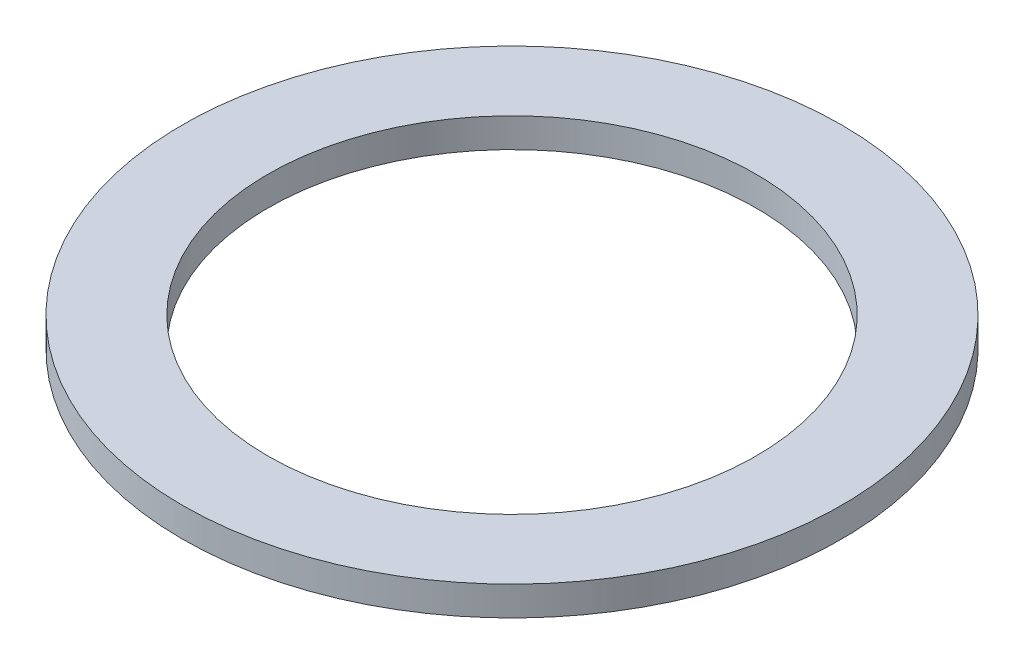
ISO-10303-21;
HEADER;
FILE_DESCRIPTION(('STEP AP214'),'2;1');
FILE_NAME('part.step','',(''),(''),'','','');
FILE_SCHEMA(('AUTOMOTIVE_DESIGN { 1 0 10303 214 1 1 1 1 }'));
ENDSEC;
DATA;
#1=APPLICATION_CONTEXT('core data for automotive mechanical design processes');
#2=APPLICATION_PROTOCOL_DEFINITION('international standard','automotive_design',2000,#1);
#3=PRODUCT_CONTEXT('',#1,'mechanical');
#4=PRODUCT('Part','Part','',(#3));
#5=PRODUCT_RELATED_PRODUCT_CATEGORY('part','',(#4));
#6=PRODUCT_DEFINITION_FORMATION('','',#4);
#7=PRODUCT_DEFINITION_CONTEXT('part definition',#1,'design');
#8=PRODUCT_DEFINITION('design','',#6,#7);
#9=PRODUCT_DEFINITION_SHAPE('','',#8);
#10=(LENGTH_UNIT() NAMED_UNIT(*) SI_UNIT(.MILLI.,.METRE.));
#11=(NAMED_UNIT(*) PLANE_ANGLE_UNIT() SI_UNIT($,.RADIAN.));
#12=(NAMED_UNIT(*) SI_UNIT($,.STERADIAN.) SOLID_ANGLE_UNIT());
#13=UNCERTAINTY_MEASURE_WITH_UNIT(LENGTH_MEASURE(1.E-05),#10,'distance_accuracy_value','');
#14=(GEOMETRIC_REPRESENTATION_CONTEXT(3) GLOBAL_UNCERTAINTY_ASSIGNED_CONTEXT((#13)) GLOBAL_UNIT_ASSIGNED_CONTEXT((#10,
#11,#12)) REPRESENTATION_CONTEXT('',''));
#15=CARTESIAN_POINT('',(0.,0.,0.));
#16=DIRECTION('',(0.,0.,1.));
#17=DIRECTION('',(1.,0.,0.));
#18=AXIS2_PLACEMENT_3D('',#15,#16,#17);
#19=CARTESIAN_POINT('',(0.,6.,0.));
#20=DIRECTION('',(0.,-1.,0.));
#21=DIRECTION('',(0.,0.,-1.));
#22=AXIS2_PLACEMENT_3D('',#19,#20,#21);
#23=CYLINDRICAL_SURFACE('',#22,67.5);
#24=CARTESIAN_POINT('',(0.,6.,0.));
#25=DIRECTION('',(0.,1.,0.));
#26=DIRECTION('',(0.,0.,1.));
#27=AXIS2_PLACEMENT_3D('',#24,#25,#26);
#28=CIRCLE('',#27,67.5);
#29=CARTESIAN_POINT('',(0.,6.,67.5));
#30=VERTEX_POINT('',#29);
#31=EDGE_CURVE('E10',#30,#30,#28,.T.);
#32=ORIENTED_EDGE('',*,*,#31,.F.);
#33=EDGE_LOOP('',(#32));
#34=FACE_BOUND('',#33,.T.);
#35=CARTESIAN_POINT('',(0.,0.,0.));
#36=DIRECTION('',(0.,1.,0.));
#37=DIRECTION('',(0.,0.,1.));
#38=AXIS2_PLACEMENT_3D('',#35,#36,#37);
#39=CIRCLE('',#38,67.5);
#40=CARTESIAN_POINT('',(0.,0.,67.5));
#41=VERTEX_POINT('',#40);
#42=EDGE_CURVE('E37',#41,#41,#39,.T.);
#43=ORIENTED_EDGE('',*,*,#42,.T.);
#44=EDGE_LOOP('',(#43));
#45=FACE_BOUND('',#44,.T.);
#46=ADVANCED_FACE('F40',(#34,#45),#23,.T.);
#47=CARTESIAN_POINT('',(0.,6.,0.));
#48=DIRECTION('',(0.,1.,0.));
#49=DIRECTION('',(0.,0.,1.));
#50=AXIS2_PLACEMENT_3D('',#47,#48,#49);
#51=PLANE('',#50);
#52=CARTESIAN_POINT('',(0.,6.,0.));
#53=DIRECTION('',(0.,1.,0.));
#54=DIRECTION('',(0.,0.,1.));
#55=AXIS2_PLACEMENT_3D('',#52,#53,#54);
#56=CIRCLE('',#55,50.);
#57=CARTESIAN_POINT('',(0.,6.,50.));
#58=VERTEX_POINT('',#57);
#59=EDGE_CURVE('E50',#58,#58,#56,.T.);
#60=ORIENTED_EDGE('',*,*,#59,.F.);
#61=EDGE_LOOP('',(#60));
#62=FACE_BOUND('',#61,.T.);
#63=ORIENTED_EDGE('',*,*,#31,.T.);
#64=EDGE_LOOP('',(#63));
#65=FACE_BOUND('',#64,.T.);
#66=ADVANCED_FACE('F59',(#62,#65),#51,.T.);
#67=CARTESIAN_POINT('',(0.,0.,0.));
#68=DIRECTION('',(0.,1.,0.));
#69=DIRECTION('',(0.,0.,1.));
#70=AXIS2_PLACEMENT_3D('',#67,#68,#69);
#71=PLANE('',#70);
#72=CARTESIAN_POINT('',(0.,0.,0.));
#73=DIRECTION('',(0.,1.,0.));
#74=DIRECTION('',(0.,0.,1.));
#75=AXIS2_PLACEMENT_3D('',#72,#73,#74);
#76=CIRCLE('',#75,50.);
#77=CARTESIAN_POINT('',(0.,0.,50.));
#78=VERTEX_POINT('',#77);
#79=EDGE_CURVE('E47',#78,#78,#76,.T.);
#80=ORIENTED_EDGE('',*,*,#79,.T.);
#81=EDGE_LOOP('',(#80));
#82=FACE_BOUND('',#81,.T.);
#83=ORIENTED_EDGE('',*,*,#42,.F.);
#84=EDGE_LOOP('',(#83));
#85=FACE_BOUND('',#84,.T.);
#86=ADVANCED_FACE('F58',(#82,#85),#71,.F.);
#87=CARTESIAN_POINT('',(0.,6.,0.));
#88=DIRECTION('',(0.,-1.,0.));
#89=DIRECTION('',(0.,0.,-1.));
#90=AXIS2_PLACEMENT_3D('',#87,#88,#89);
#91=CYLINDRICAL_SURFACE('',#90,50.);
#92=ORIENTED_EDGE('',*,*,#59,.T.);
#93=EDGE_LOOP('',(#92));
#94=FACE_BOUND('',#93,.T.);
#95=ORIENTED_EDGE('',*,*,#79,.F.);
#96=EDGE_LOOP('',(#95));
#97=FACE_BOUND('',#96,.T.);
#98=ADVANCED_FACE('F54',(#94,#97),#91,.F.);
#99=CLOSED_SHELL('',(#46,#66,#86,#98));
#100=MANIFOLD_SOLID_BREP('B2',#99);
#101=ADVANCED_BREP_SHAPE_REPRESENTATION('',(#18,#100),#14);
#102=SHAPE_DEFINITION_REPRESENTATION(#9,#101);
ENDSEC;
END-ISO-10303-21;
